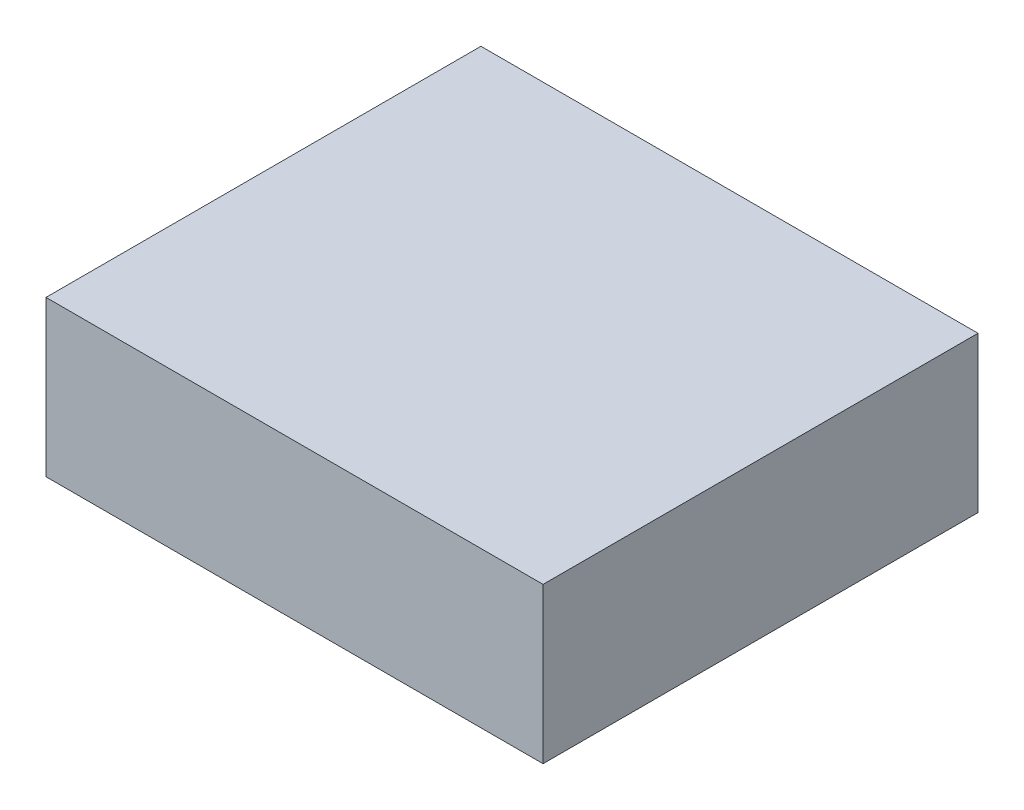
ISO-10303-21;
HEADER;
FILE_DESCRIPTION(('STEP AP214'),'2;1');
FILE_NAME('part.step','',(''),(''),'','','');
FILE_SCHEMA(('AUTOMOTIVE_DESIGN { 1 0 10303 214 1 1 1 1 }'));
ENDSEC;
DATA;
#1=APPLICATION_CONTEXT('core data for automotive mechanical design processes');
#2=APPLICATION_PROTOCOL_DEFINITION('international standard','automotive_design',2000,#1);
#3=PRODUCT_CONTEXT('',#1,'mechanical');
#4=PRODUCT('Part','Part','',(#3));
#5=PRODUCT_RELATED_PRODUCT_CATEGORY('part','',(#4));
#6=PRODUCT_DEFINITION_FORMATION('','',#4);
#7=PRODUCT_DEFINITION_CONTEXT('part definition',#1,'design');
#8=PRODUCT_DEFINITION('design','',#6,#7);
#9=PRODUCT_DEFINITION_SHAPE('','',#8);
#10=(LENGTH_UNIT() NAMED_UNIT(*) SI_UNIT(.MILLI.,.METRE.));
#11=(NAMED_UNIT(*) PLANE_ANGLE_UNIT() SI_UNIT($,.RADIAN.));
#12=(NAMED_UNIT(*) SI_UNIT($,.STERADIAN.) SOLID_ANGLE_UNIT());
#13=UNCERTAINTY_MEASURE_WITH_UNIT(LENGTH_MEASURE(1.E-05),#10,'distance_accuracy_value','');
#14=(GEOMETRIC_REPRESENTATION_CONTEXT(3) GLOBAL_UNCERTAINTY_ASSIGNED_CONTEXT((#13)) GLOBAL_UNIT_ASSIGNED_CONTEXT((#10,
#11,#12)) REPRESENTATION_CONTEXT('',''));
#15=CARTESIAN_POINT('',(0.,0.,0.));
#16=DIRECTION('',(0.,0.,1.));
#17=DIRECTION('',(1.,0.,0.));
#18=AXIS2_PLACEMENT_3D('',#15,#16,#17);
#19=CARTESIAN_POINT('',(-5.08,-3.175,4.445));
#20=DIRECTION('',(1.,0.,0.));
#21=DIRECTION('',(0.,0.,-1.));
#22=AXIS2_PLACEMENT_3D('',#19,#20,#21);
#23=PLANE('',#22);
#24=DIRECTION('',(0.,0.,-1.));
#25=VECTOR('',#24,1.);
#26=CARTESIAN_POINT('',(-5.08,-3.175,4.445));
#27=LINE('',#26,#25);
#28=CARTESIAN_POINT('',(-5.08,-3.175,4.445));
#29=VERTEX_POINT('',#28);
#30=CARTESIAN_POINT('',(-5.08,-3.175,-4.445));
#31=VERTEX_POINT('',#30);
#32=EDGE_CURVE('E12',#29,#31,#27,.T.);
#33=ORIENTED_EDGE('',*,*,#32,.F.);
#34=DIRECTION('',(0.,-1.,0.));
#35=VECTOR('',#34,1.);
#36=CARTESIAN_POINT('',(-5.08,-3.175,4.445));
#37=LINE('',#36,#35);
#38=CARTESIAN_POINT('',(-5.08,0.,4.445));
#39=VERTEX_POINT('',#38);
#40=EDGE_CURVE('E84',#39,#29,#37,.T.);
#41=ORIENTED_EDGE('',*,*,#40,.F.);
#42=DIRECTION('',(0.,0.,-1.));
#43=VECTOR('',#42,1.);
#44=CARTESIAN_POINT('',(-5.08,0.,4.445));
#45=LINE('',#44,#43);
#46=CARTESIAN_POINT('',(-5.08,0.,-4.445));
#47=VERTEX_POINT('',#46);
#48=EDGE_CURVE('E152',#39,#47,#45,.T.);
#49=ORIENTED_EDGE('',*,*,#48,.T.);
#50=DIRECTION('',(0.,-1.,0.));
#51=VECTOR('',#50,1.);
#52=CARTESIAN_POINT('',(-5.08,-3.175,-4.445));
#53=LINE('',#52,#51);
#54=EDGE_CURVE('E142',#47,#31,#53,.T.);
#55=ORIENTED_EDGE('',*,*,#54,.T.);
#56=EDGE_LOOP('',(#33,#41,#49,#55));
#57=FACE_BOUND('',#56,.T.);
#58=ADVANCED_FACE('F35',(#57),#23,.F.);
#59=CARTESIAN_POINT('',(5.08,-3.175,4.445));
#60=DIRECTION('',(0.,1.,0.));
#61=DIRECTION('',(-1.,0.,0.));
#62=AXIS2_PLACEMENT_3D('',#59,#60,#61);
#63=PLANE('',#62);
#64=DIRECTION('',(0.,0.,-1.));
#65=VECTOR('',#64,1.);
#66=CARTESIAN_POINT('',(-2.54,-3.175,2.54));
#67=LINE('',#66,#65);
#68=CARTESIAN_POINT('',(-2.54,-3.175,2.54));
#69=VERTEX_POINT('',#68);
#70=CARTESIAN_POINT('',(-2.54,-3.175,-2.54));
#71=VERTEX_POINT('',#70);
#72=EDGE_CURVE('E136',#69,#71,#67,.T.);
#73=ORIENTED_EDGE('',*,*,#72,.F.);
#74=DIRECTION('',(-1.,0.,0.));
#75=VECTOR('',#74,1.);
#76=CARTESIAN_POINT('',(2.54,-3.175,2.54));
#77=LINE('',#76,#75);
#78=CARTESIAN_POINT('',(2.54,-3.175,2.54));
#79=VERTEX_POINT('',#78);
#80=EDGE_CURVE('E49',#79,#69,#77,.T.);
#81=ORIENTED_EDGE('',*,*,#80,.F.);
#82=DIRECTION('',(0.,0.,1.));
#83=VECTOR('',#82,1.);
#84=CARTESIAN_POINT('',(2.54,-3.175,-2.54));
#85=LINE('',#84,#83);
#86=CARTESIAN_POINT('',(2.54,-3.175,-2.54));
#87=VERTEX_POINT('',#86);
#88=EDGE_CURVE('E127',#87,#79,#85,.T.);
#89=ORIENTED_EDGE('',*,*,#88,.F.);
#90=DIRECTION('',(1.,0.,0.));
#91=VECTOR('',#90,1.);
#92=CARTESIAN_POINT('',(-2.54,-3.175,-2.54));
#93=LINE('',#92,#91);
#94=EDGE_CURVE('E130',#71,#87,#93,.T.);
#95=ORIENTED_EDGE('',*,*,#94,.F.);
#96=EDGE_LOOP('',(#73,#81,#89,#95));
#97=FACE_BOUND('',#96,.T.);
#98=DIRECTION('',(1.,0.,0.));
#99=VECTOR('',#98,1.);
#100=CARTESIAN_POINT('',(5.08,-3.175,-4.445));
#101=LINE('',#100,#99);
#102=CARTESIAN_POINT('',(5.08,-3.175,-4.445));
#103=VERTEX_POINT('',#102);
#104=EDGE_CURVE('E154',#31,#103,#101,.T.);
#105=ORIENTED_EDGE('',*,*,#104,.T.);
#106=DIRECTION('',(0.,0.,-1.));
#107=VECTOR('',#106,1.);
#108=CARTESIAN_POINT('',(5.08,-3.175,4.445));
#109=LINE('',#108,#107);
#110=CARTESIAN_POINT('',(5.08,-3.175,4.445));
#111=VERTEX_POINT('',#110);
#112=EDGE_CURVE('E42',#111,#103,#109,.T.);
#113=ORIENTED_EDGE('',*,*,#112,.F.);
#114=DIRECTION('',(1.,0.,0.));
#115=VECTOR('',#114,1.);
#116=CARTESIAN_POINT('',(5.08,-3.175,4.445));
#117=LINE('',#116,#115);
#118=EDGE_CURVE('E147',#29,#111,#117,.T.);
#119=ORIENTED_EDGE('',*,*,#118,.F.);
#120=ORIENTED_EDGE('',*,*,#32,.T.);
#121=EDGE_LOOP('',(#105,#113,#119,#120));
#122=FACE_BOUND('',#121,.T.);
#123=ADVANCED_FACE('F184',(#97,#122),#63,.F.);
#124=CARTESIAN_POINT('',(5.08,0.,4.445));
#125=DIRECTION('',(-1.,0.,0.));
#126=DIRECTION('',(0.,0.,1.));
#127=AXIS2_PLACEMENT_3D('',#124,#125,#126);
#128=PLANE('',#127);
#129=DIRECTION('',(0.,1.,0.));
#130=VECTOR('',#129,1.);
#131=CARTESIAN_POINT('',(5.08,0.,-4.445));
#132=LINE('',#131,#130);
#133=CARTESIAN_POINT('',(5.08,0.,-4.445));
#134=VERTEX_POINT('',#133);
#135=EDGE_CURVE('E156',#103,#134,#132,.T.);
#136=ORIENTED_EDGE('',*,*,#135,.T.);
#137=DIRECTION('',(0.,0.,-1.));
#138=VECTOR('',#137,1.);
#139=CARTESIAN_POINT('',(5.08,0.,4.445));
#140=LINE('',#139,#138);
#141=CARTESIAN_POINT('',(5.08,0.,4.445));
#142=VERTEX_POINT('',#141);
#143=EDGE_CURVE('E160',#142,#134,#140,.T.);
#144=ORIENTED_EDGE('',*,*,#143,.F.);
#145=DIRECTION('',(0.,1.,0.));
#146=VECTOR('',#145,1.);
#147=CARTESIAN_POINT('',(5.08,0.,4.445));
#148=LINE('',#147,#146);
#149=EDGE_CURVE('E149',#111,#142,#148,.T.);
#150=ORIENTED_EDGE('',*,*,#149,.F.);
#151=ORIENTED_EDGE('',*,*,#112,.T.);
#152=EDGE_LOOP('',(#136,#144,#150,#151));
#153=FACE_BOUND('',#152,.T.);
#154=ADVANCED_FACE('F166',(#153),#128,.F.);
#155=CARTESIAN_POINT('',(-5.08,0.,4.445));
#156=DIRECTION('',(0.,-1.,0.));
#157=DIRECTION('',(0.,0.,-1.));
#158=AXIS2_PLACEMENT_3D('',#155,#156,#157);
#159=PLANE('',#158);
#160=DIRECTION('',(-1.,0.,0.));
#161=VECTOR('',#160,1.);
#162=CARTESIAN_POINT('',(-5.08,0.,-4.445));
#163=LINE('',#162,#161);
#164=EDGE_CURVE('E79',#134,#47,#163,.T.);
#165=ORIENTED_EDGE('',*,*,#164,.T.);
#166=ORIENTED_EDGE('',*,*,#48,.F.);
#167=DIRECTION('',(-1.,0.,0.));
#168=VECTOR('',#167,1.);
#169=CARTESIAN_POINT('',(-5.08,0.,4.445));
#170=LINE('',#169,#168);
#171=EDGE_CURVE('E58',#142,#39,#170,.T.);
#172=ORIENTED_EDGE('',*,*,#171,.F.);
#173=ORIENTED_EDGE('',*,*,#143,.T.);
#174=EDGE_LOOP('',(#165,#166,#172,#173));
#175=FACE_BOUND('',#174,.T.);
#176=ADVANCED_FACE('F175',(#175),#159,.F.);
#177=CARTESIAN_POINT('',(0.,0.,4.445));
#178=DIRECTION('',(0.,0.,-1.));
#179=DIRECTION('',(-1.,0.,0.));
#180=AXIS2_PLACEMENT_3D('',#177,#178,#179);
#181=PLANE('',#180);
#182=ORIENTED_EDGE('',*,*,#149,.T.);
#183=ORIENTED_EDGE('',*,*,#171,.T.);
#184=ORIENTED_EDGE('',*,*,#40,.T.);
#185=ORIENTED_EDGE('',*,*,#118,.T.);
#186=EDGE_LOOP('',(#182,#183,#184,#185));
#187=FACE_BOUND('',#186,.T.);
#188=ADVANCED_FACE('F177',(#187),#181,.F.);
#189=CARTESIAN_POINT('',(0.,0.,-4.445));
#190=DIRECTION('',(0.,0.,-1.));
#191=DIRECTION('',(-1.,0.,0.));
#192=AXIS2_PLACEMENT_3D('',#189,#190,#191);
#193=PLANE('',#192);
#194=ORIENTED_EDGE('',*,*,#104,.F.);
#195=ORIENTED_EDGE('',*,*,#54,.F.);
#196=ORIENTED_EDGE('',*,*,#164,.F.);
#197=ORIENTED_EDGE('',*,*,#135,.F.);
#198=EDGE_LOOP('',(#194,#195,#196,#197));
#199=FACE_BOUND('',#198,.T.);
#200=ADVANCED_FACE('F171',(#199),#193,.T.);
#201=CARTESIAN_POINT('',(2.54,-1.27,2.54));
#202=DIRECTION('',(0.,0.,1.));
#203=DIRECTION('',(1.,0.,0.));
#204=AXIS2_PLACEMENT_3D('',#201,#202,#203);
#205=PLANE('',#204);
#206=ORIENTED_EDGE('',*,*,#80,.T.);
#207=DIRECTION('',(0.,-1.,0.));
#208=VECTOR('',#207,1.);
#209=CARTESIAN_POINT('',(-2.54,-1.27,2.54));
#210=LINE('',#209,#208);
#211=CARTESIAN_POINT('',(-2.54,-1.27,2.54));
#212=VERTEX_POINT('',#211);
#213=EDGE_CURVE('E105',#212,#69,#210,.T.);
#214=ORIENTED_EDGE('',*,*,#213,.F.);
#215=DIRECTION('',(-1.,0.,0.));
#216=VECTOR('',#215,1.);
#217=CARTESIAN_POINT('',(2.54,-1.27,2.54));
#218=LINE('',#217,#216);
#219=CARTESIAN_POINT('',(2.54,-1.27,2.54));
#220=VERTEX_POINT('',#219);
#221=EDGE_CURVE('E109',#220,#212,#218,.T.);
#222=ORIENTED_EDGE('',*,*,#221,.F.);
#223=DIRECTION('',(0.,-1.,0.));
#224=VECTOR('',#223,1.);
#225=CARTESIAN_POINT('',(2.54,-1.27,2.54));
#226=LINE('',#225,#224);
#227=EDGE_CURVE('E140',#220,#79,#226,.T.);
#228=ORIENTED_EDGE('',*,*,#227,.T.);
#229=EDGE_LOOP('',(#206,#214,#222,#228));
#230=FACE_BOUND('',#229,.T.);
#231=ADVANCED_FACE('F107',(#230),#205,.F.);
#232=CARTESIAN_POINT('',(2.54,-1.27,-2.54));
#233=DIRECTION('',(1.,0.,0.));
#234=DIRECTION('',(0.,1.,0.));
#235=AXIS2_PLACEMENT_3D('',#232,#233,#234);
#236=PLANE('',#235);
#237=ORIENTED_EDGE('',*,*,#88,.T.);
#238=ORIENTED_EDGE('',*,*,#227,.F.);
#239=DIRECTION('',(0.,0.,1.));
#240=VECTOR('',#239,1.);
#241=CARTESIAN_POINT('',(2.54,-1.27,-2.54));
#242=LINE('',#241,#240);
#243=CARTESIAN_POINT('',(2.54,-1.27,-2.54));
#244=VERTEX_POINT('',#243);
#245=EDGE_CURVE('E115',#244,#220,#242,.T.);
#246=ORIENTED_EDGE('',*,*,#245,.F.);
#247=DIRECTION('',(0.,-1.,0.));
#248=VECTOR('',#247,1.);
#249=CARTESIAN_POINT('',(2.54,-1.27,-2.54));
#250=LINE('',#249,#248);
#251=EDGE_CURVE('E143',#244,#87,#250,.T.);
#252=ORIENTED_EDGE('',*,*,#251,.T.);
#253=EDGE_LOOP('',(#237,#238,#246,#252));
#254=FACE_BOUND('',#253,.T.);
#255=ADVANCED_FACE('F199',(#254),#236,.F.);
#256=CARTESIAN_POINT('',(-2.54,-1.27,-2.54));
#257=DIRECTION('',(0.,0.,-1.));
#258=DIRECTION('',(-1.,0.,0.));
#259=AXIS2_PLACEMENT_3D('',#256,#257,#258);
#260=PLANE('',#259);
#261=ORIENTED_EDGE('',*,*,#94,.T.);
#262=ORIENTED_EDGE('',*,*,#251,.F.);
#263=DIRECTION('',(1.,0.,0.));
#264=VECTOR('',#263,1.);
#265=CARTESIAN_POINT('',(-2.54,-1.27,-2.54));
#266=LINE('',#265,#264);
#267=CARTESIAN_POINT('',(-2.54,-1.27,-2.54));
#268=VERTEX_POINT('',#267);
#269=EDGE_CURVE('E123',#268,#244,#266,.T.);
#270=ORIENTED_EDGE('',*,*,#269,.F.);
#271=DIRECTION('',(0.,-1.,0.));
#272=VECTOR('',#271,1.);
#273=CARTESIAN_POINT('',(-2.54,-1.27,-2.54));
#274=LINE('',#273,#272);
#275=EDGE_CURVE('E114',#268,#71,#274,.T.);
#276=ORIENTED_EDGE('',*,*,#275,.T.);
#277=EDGE_LOOP('',(#261,#262,#270,#276));
#278=FACE_BOUND('',#277,.T.);
#279=ADVANCED_FACE('F197',(#278),#260,.F.);
#280=CARTESIAN_POINT('',(-2.54,-1.27,2.54));
#281=DIRECTION('',(-1.,0.,0.));
#282=DIRECTION('',(0.,-1.,0.));
#283=AXIS2_PLACEMENT_3D('',#280,#281,#282);
#284=PLANE('',#283);
#285=ORIENTED_EDGE('',*,*,#72,.T.);
#286=ORIENTED_EDGE('',*,*,#275,.F.);
#287=DIRECTION('',(0.,0.,-1.));
#288=VECTOR('',#287,1.);
#289=CARTESIAN_POINT('',(-2.54,-1.27,2.54));
#290=LINE('',#289,#288);
#291=EDGE_CURVE('E118',#212,#268,#290,.T.);
#292=ORIENTED_EDGE('',*,*,#291,.F.);
#293=ORIENTED_EDGE('',*,*,#213,.T.);
#294=EDGE_LOOP('',(#285,#286,#292,#293));
#295=FACE_BOUND('',#294,.T.);
#296=ADVANCED_FACE('F119',(#295),#284,.F.);
#297=CARTESIAN_POINT('',(0.,-1.27,0.));
#298=DIRECTION('',(0.,-1.,0.));
#299=DIRECTION('',(1.,0.,0.));
#300=AXIS2_PLACEMENT_3D('',#297,#298,#299);
#301=PLANE('',#300);
#302=ORIENTED_EDGE('',*,*,#221,.T.);
#303=ORIENTED_EDGE('',*,*,#291,.T.);
#304=ORIENTED_EDGE('',*,*,#269,.T.);
#305=ORIENTED_EDGE('',*,*,#245,.T.);
#306=EDGE_LOOP('',(#302,#303,#304,#305));
#307=FACE_BOUND('',#306,.T.);
#308=ADVANCED_FACE('F125',(#307),#301,.T.);
#309=CLOSED_SHELL('',(#58,#123,#154,#176,#188,#200,#231,#255,#279,#296,#308));
#310=MANIFOLD_SOLID_BREP('B2',#309);
#311=ADVANCED_BREP_SHAPE_REPRESENTATION('',(#18,#310),#14);
#312=SHAPE_DEFINITION_REPRESENTATION(#9,#311);
ENDSEC;
END-ISO-10303-21;
